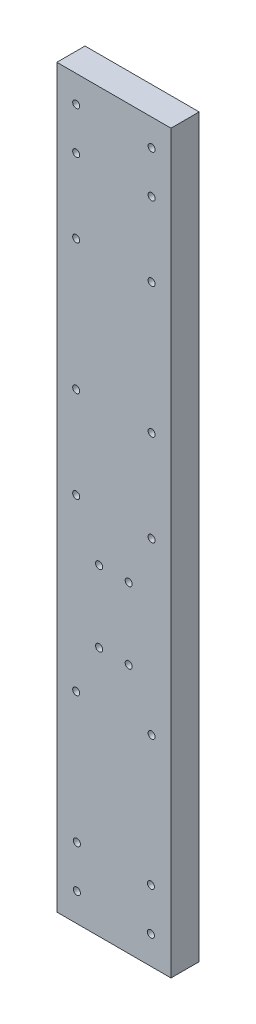
ISO-10303-21;
HEADER;
FILE_DESCRIPTION(('STEP AP214'),'2;1');
FILE_NAME('part.step','',(''),(''),'','','');
FILE_SCHEMA(('AUTOMOTIVE_DESIGN { 1 0 10303 214 1 1 1 1 }'));
ENDSEC;
DATA;
#1=APPLICATION_CONTEXT('core data for automotive mechanical design processes');
#2=APPLICATION_PROTOCOL_DEFINITION('international standard','automotive_design',2000,#1);
#3=PRODUCT_CONTEXT('',#1,'mechanical');
#4=PRODUCT('Part','Part','',(#3));
#5=PRODUCT_RELATED_PRODUCT_CATEGORY('part','',(#4));
#6=PRODUCT_DEFINITION_FORMATION('','',#4);
#7=PRODUCT_DEFINITION_CONTEXT('part definition',#1,'design');
#8=PRODUCT_DEFINITION('design','',#6,#7);
#9=PRODUCT_DEFINITION_SHAPE('','',#8);
#10=(LENGTH_UNIT() NAMED_UNIT(*) SI_UNIT(.MILLI.,.METRE.));
#11=(NAMED_UNIT(*) PLANE_ANGLE_UNIT() SI_UNIT($,.RADIAN.));
#12=(NAMED_UNIT(*) SI_UNIT($,.STERADIAN.) SOLID_ANGLE_UNIT());
#13=UNCERTAINTY_MEASURE_WITH_UNIT(LENGTH_MEASURE(1.E-05),#10,'distance_accuracy_value','');
#14=(GEOMETRIC_REPRESENTATION_CONTEXT(3) GLOBAL_UNCERTAINTY_ASSIGNED_CONTEXT((#13)) GLOBAL_UNIT_ASSIGNED_CONTEXT((#10,
#11,#12)) REPRESENTATION_CONTEXT('',''));
#15=CARTESIAN_POINT('',(0.,0.,0.));
#16=DIRECTION('',(0.,0.,1.));
#17=DIRECTION('',(1.,0.,0.));
#18=AXIS2_PLACEMENT_3D('',#15,#16,#17);
#19=CARTESIAN_POINT('',(0.,0.,4.));
#20=DIRECTION('',(0.,0.,-1.));
#21=DIRECTION('',(-1.,0.,0.));
#22=AXIS2_PLACEMENT_3D('',#19,#20,#21);
#23=PLANE('',#22);
#24=CARTESIAN_POINT('',(13.4499999999989,100.665,4.));
#25=DIRECTION('',(0.,0.,1.));
#26=DIRECTION('',(-1.,0.,0.));
#27=AXIS2_PLACEMENT_3D('',#24,#25,#26);
#28=CIRCLE('',#27,0.499999999999994);
#29=CARTESIAN_POINT('',(12.9499999999989,100.665,4.));
#30=VERTEX_POINT('',#29);
#31=EDGE_CURVE('E217',#30,#30,#28,.T.);
#32=ORIENTED_EDGE('',*,*,#31,.F.);
#33=EDGE_LOOP('',(#32));
#34=FACE_BOUND('',#33,.T.);
#35=CARTESIAN_POINT('',(13.350000000001,10.,4.));
#36=DIRECTION('',(0.,0.,1.));
#37=DIRECTION('',(-1.,0.,0.));
#38=AXIS2_PLACEMENT_3D('',#35,#36,#37);
#39=CIRCLE('',#38,0.499999999999995);
#40=CARTESIAN_POINT('',(12.850000000001,10.,4.));
#41=VERTEX_POINT('',#40);
#42=EDGE_CURVE('E205',#41,#41,#39,.T.);
#43=ORIENTED_EDGE('',*,*,#42,.F.);
#44=EDGE_LOOP('',(#43));
#45=FACE_BOUND('',#44,.T.);
#46=CARTESIAN_POINT('',(2.85,10.,4.));
#47=DIRECTION('',(0.,0.,1.));
#48=DIRECTION('',(1.,0.,0.));
#49=AXIS2_PLACEMENT_3D('',#46,#47,#48);
#50=CIRCLE('',#49,0.499999999999999);
#51=CARTESIAN_POINT('',(3.35,10.,4.));
#52=VERTEX_POINT('',#51);
#53=EDGE_CURVE('E193',#52,#52,#50,.T.);
#54=ORIENTED_EDGE('',*,*,#53,.F.);
#55=EDGE_LOOP('',(#54));
#56=FACE_BOUND('',#55,.T.);
#57=CARTESIAN_POINT('',(13.4499999999999,94.665,4.));
#58=DIRECTION('',(0.,0.,1.));
#59=DIRECTION('',(1.,0.,0.));
#60=AXIS2_PLACEMENT_3D('',#57,#58,#59);
#61=CIRCLE('',#60,0.499999999999994);
#62=CARTESIAN_POINT('',(13.9499999999999,94.665,4.));
#63=VERTEX_POINT('',#62);
#64=EDGE_CURVE('E181',#63,#63,#61,.T.);
#65=ORIENTED_EDGE('',*,*,#64,.F.);
#66=EDGE_LOOP('',(#65));
#67=FACE_BOUND('',#66,.T.);
#68=CARTESIAN_POINT('',(13.4499999999987,84.165,4.));
#69=DIRECTION('',(0.,0.,1.));
#70=DIRECTION('',(1.,0.,0.));
#71=AXIS2_PLACEMENT_3D('',#68,#69,#70);
#72=CIRCLE('',#71,0.499999999999994);
#73=CARTESIAN_POINT('',(13.9499999999987,84.165,4.));
#74=VERTEX_POINT('',#73);
#75=EDGE_CURVE('E169',#74,#74,#72,.T.);
#76=ORIENTED_EDGE('',*,*,#75,.F.);
#77=EDGE_LOOP('',(#76));
#78=FACE_BOUND('',#77,.T.);
#79=CARTESIAN_POINT('',(13.45,28.5,4.));
#80=DIRECTION('',(0.,0.,1.));
#81=DIRECTION('',(1.,0.,0.));
#82=AXIS2_PLACEMENT_3D('',#79,#80,#81);
#83=CIRCLE('',#82,0.499999999999993);
#84=CARTESIAN_POINT('',(13.95,28.5,4.));
#85=VERTEX_POINT('',#84);
#86=EDGE_CURVE('E157',#85,#85,#83,.T.);
#87=ORIENTED_EDGE('',*,*,#86,.F.);
#88=EDGE_LOOP('',(#87));
#89=FACE_BOUND('',#88,.T.);
#90=CARTESIAN_POINT('',(10.2,35.5,4.));
#91=DIRECTION('',(0.,0.,1.));
#92=DIRECTION('',(1.,0.,0.));
#93=AXIS2_PLACEMENT_3D('',#90,#91,#92);
#94=CIRCLE('',#93,0.499999999999999);
#95=CARTESIAN_POINT('',(10.7,35.5,4.));
#96=VERTEX_POINT('',#95);
#97=EDGE_CURVE('E145',#96,#96,#94,.T.);
#98=ORIENTED_EDGE('',*,*,#97,.F.);
#99=EDGE_LOOP('',(#98));
#100=FACE_BOUND('',#99,.T.);
#101=CARTESIAN_POINT('',(13.4500000000003,65.64,4.));
#102=DIRECTION('',(0.,0.,1.));
#103=DIRECTION('',(1.,0.,0.));
#104=AXIS2_PLACEMENT_3D('',#101,#102,#103);
#105=CIRCLE('',#104,0.499999999999994);
#106=CARTESIAN_POINT('',(13.9500000000003,65.64,4.));
#107=VERTEX_POINT('',#106);
#108=EDGE_CURVE('E133',#107,#107,#105,.T.);
#109=ORIENTED_EDGE('',*,*,#108,.F.);
#110=EDGE_LOOP('',(#109));
#111=FACE_BOUND('',#110,.T.);
#112=CARTESIAN_POINT('',(13.45,52.64,4.));
#113=DIRECTION('',(0.,0.,1.));
#114=DIRECTION('',(1.,0.,0.));
#115=AXIS2_PLACEMENT_3D('',#112,#113,#114);
#116=CIRCLE('',#115,0.499999999999999);
#117=CARTESIAN_POINT('',(13.95,52.64,4.));
#118=VERTEX_POINT('',#117);
#119=EDGE_CURVE('E121',#118,#118,#116,.T.);
#120=ORIENTED_EDGE('',*,*,#119,.F.);
#121=EDGE_LOOP('',(#120));
#122=FACE_BOUND('',#121,.T.);
#123=CARTESIAN_POINT('',(10.2,45.64,4.));
#124=DIRECTION('',(0.,0.,1.));
#125=DIRECTION('',(1.,0.,0.));
#126=AXIS2_PLACEMENT_3D('',#123,#124,#125);
#127=CIRCLE('',#126,0.499999999999999);
#128=CARTESIAN_POINT('',(10.7,45.64,4.));
#129=VERTEX_POINT('',#128);
#130=EDGE_CURVE('E100',#129,#129,#127,.T.);
#131=ORIENTED_EDGE('',*,*,#130,.F.);
#132=EDGE_LOOP('',(#131));
#133=FACE_BOUND('',#132,.T.);
#134=DIRECTION('',(1.,0.,0.));
#135=VECTOR('',#134,1.);
#136=CARTESIAN_POINT('',(0.,0.,4.));
#137=LINE('',#136,#135);
#138=CARTESIAN_POINT('',(0.,0.,4.));
#139=VERTEX_POINT('',#138);
#140=CARTESIAN_POINT('',(16.2,0.,4.));
#141=VERTEX_POINT('',#140);
#142=EDGE_CURVE('E85',#139,#141,#137,.T.);
#143=ORIENTED_EDGE('',*,*,#142,.T.);
#144=DIRECTION('',(0.,1.,0.));
#145=VECTOR('',#144,1.);
#146=CARTESIAN_POINT('',(16.2,104.46,4.));
#147=LINE('',#146,#145);
#148=CARTESIAN_POINT('',(16.2,104.46,4.));
#149=VERTEX_POINT('',#148);
#150=EDGE_CURVE('E80',#141,#149,#147,.T.);
#151=ORIENTED_EDGE('',*,*,#150,.T.);
#152=DIRECTION('',(-1.,0.,0.));
#153=VECTOR('',#152,1.);
#154=CARTESIAN_POINT('',(0.,104.46,4.));
#155=LINE('',#154,#153);
#156=CARTESIAN_POINT('',(0.,104.46,4.));
#157=VERTEX_POINT('',#156);
#158=EDGE_CURVE('E83',#149,#157,#155,.T.);
#159=ORIENTED_EDGE('',*,*,#158,.T.);
#160=DIRECTION('',(0.,-1.,0.));
#161=VECTOR('',#160,1.);
#162=CARTESIAN_POINT('',(0.,104.46,4.));
#163=LINE('',#162,#161);
#164=EDGE_CURVE('E50',#157,#139,#163,.T.);
#165=ORIENTED_EDGE('',*,*,#164,.T.);
#166=EDGE_LOOP('',(#143,#151,#159,#165));
#167=FACE_BOUND('',#166,.T.);
#168=CARTESIAN_POINT('',(5.99999999999999,45.64,4.));
#169=DIRECTION('',(0.,0.,1.));
#170=DIRECTION('',(1.,0.,0.));
#171=AXIS2_PLACEMENT_3D('',#168,#169,#170);
#172=CIRCLE('',#171,0.500000000000002);
#173=CARTESIAN_POINT('',(6.5,45.64,4.));
#174=VERTEX_POINT('',#173);
#175=EDGE_CURVE('E115',#174,#174,#172,.T.);
#176=ORIENTED_EDGE('',*,*,#175,.F.);
#177=EDGE_LOOP('',(#176));
#178=FACE_BOUND('',#177,.T.);
#179=CARTESIAN_POINT('',(2.74999999999999,52.64,4.));
#180=DIRECTION('',(0.,0.,1.));
#181=DIRECTION('',(1.,0.,0.));
#182=AXIS2_PLACEMENT_3D('',#179,#180,#181);
#183=CIRCLE('',#182,0.499999999999999);
#184=CARTESIAN_POINT('',(3.24999999999999,52.64,4.));
#185=VERTEX_POINT('',#184);
#186=EDGE_CURVE('E127',#185,#185,#183,.T.);
#187=ORIENTED_EDGE('',*,*,#186,.F.);
#188=EDGE_LOOP('',(#187));
#189=FACE_BOUND('',#188,.T.);
#190=CARTESIAN_POINT('',(2.74999999999999,65.64,4.));
#191=DIRECTION('',(0.,0.,1.));
#192=DIRECTION('',(1.,0.,0.));
#193=AXIS2_PLACEMENT_3D('',#190,#191,#192);
#194=CIRCLE('',#193,0.499999999999999);
#195=CARTESIAN_POINT('',(3.24999999999999,65.64,4.));
#196=VERTEX_POINT('',#195);
#197=EDGE_CURVE('E139',#196,#196,#194,.T.);
#198=ORIENTED_EDGE('',*,*,#197,.F.);
#199=EDGE_LOOP('',(#198));
#200=FACE_BOUND('',#199,.T.);
#201=CARTESIAN_POINT('',(6.,35.5,4.));
#202=DIRECTION('',(0.,0.,1.));
#203=DIRECTION('',(1.,0.,0.));
#204=AXIS2_PLACEMENT_3D('',#201,#202,#203);
#205=CIRCLE('',#204,0.5);
#206=CARTESIAN_POINT('',(6.5,35.5,4.));
#207=VERTEX_POINT('',#206);
#208=EDGE_CURVE('E151',#207,#207,#205,.T.);
#209=ORIENTED_EDGE('',*,*,#208,.F.);
#210=EDGE_LOOP('',(#209));
#211=FACE_BOUND('',#210,.T.);
#212=CARTESIAN_POINT('',(2.75,28.5,4.));
#213=DIRECTION('',(0.,0.,1.));
#214=DIRECTION('',(1.,0.,0.));
#215=AXIS2_PLACEMENT_3D('',#212,#213,#214);
#216=CIRCLE('',#215,0.499999999999999);
#217=CARTESIAN_POINT('',(3.25,28.5,4.));
#218=VERTEX_POINT('',#217);
#219=EDGE_CURVE('E163',#218,#218,#216,.T.);
#220=ORIENTED_EDGE('',*,*,#219,.F.);
#221=EDGE_LOOP('',(#220));
#222=FACE_BOUND('',#221,.T.);
#223=CARTESIAN_POINT('',(2.74999999999866,84.165,4.));
#224=DIRECTION('',(0.,0.,1.));
#225=DIRECTION('',(1.,0.,0.));
#226=AXIS2_PLACEMENT_3D('',#223,#224,#225);
#227=CIRCLE('',#226,0.499999999999999);
#228=CARTESIAN_POINT('',(3.24999999999866,84.165,4.));
#229=VERTEX_POINT('',#228);
#230=EDGE_CURVE('E175',#229,#229,#227,.T.);
#231=ORIENTED_EDGE('',*,*,#230,.F.);
#232=EDGE_LOOP('',(#231));
#233=FACE_BOUND('',#232,.T.);
#234=CARTESIAN_POINT('',(2.74999999999866,94.665,4.));
#235=DIRECTION('',(0.,0.,1.));
#236=DIRECTION('',(1.,0.,0.));
#237=AXIS2_PLACEMENT_3D('',#234,#235,#236);
#238=CIRCLE('',#237,0.499999999999999);
#239=CARTESIAN_POINT('',(3.24999999999866,94.665,4.));
#240=VERTEX_POINT('',#239);
#241=EDGE_CURVE('E187',#240,#240,#238,.T.);
#242=ORIENTED_EDGE('',*,*,#241,.F.);
#243=EDGE_LOOP('',(#242));
#244=FACE_BOUND('',#243,.T.);
#245=CARTESIAN_POINT('',(2.85,4.,4.));
#246=DIRECTION('',(0.,0.,1.));
#247=DIRECTION('',(1.,0.,0.));
#248=AXIS2_PLACEMENT_3D('',#245,#246,#247);
#249=CIRCLE('',#248,0.499999999999999);
#250=CARTESIAN_POINT('',(3.35,4.,4.));
#251=VERTEX_POINT('',#250);
#252=EDGE_CURVE('E199',#251,#251,#249,.T.);
#253=ORIENTED_EDGE('',*,*,#252,.F.);
#254=EDGE_LOOP('',(#253));
#255=FACE_BOUND('',#254,.T.);
#256=CARTESIAN_POINT('',(13.350000000001,4.,4.));
#257=DIRECTION('',(0.,0.,1.));
#258=DIRECTION('',(-1.,0.,0.));
#259=AXIS2_PLACEMENT_3D('',#256,#257,#258);
#260=CIRCLE('',#259,0.499999999999999);
#261=CARTESIAN_POINT('',(12.850000000001,4.,4.));
#262=VERTEX_POINT('',#261);
#263=EDGE_CURVE('E211',#262,#262,#260,.T.);
#264=ORIENTED_EDGE('',*,*,#263,.F.);
#265=EDGE_LOOP('',(#264));
#266=FACE_BOUND('',#265,.T.);
#267=CARTESIAN_POINT('',(2.74999999999866,100.665,4.));
#268=DIRECTION('',(0.,0.,1.));
#269=DIRECTION('',(-1.,0.,0.));
#270=AXIS2_PLACEMENT_3D('',#267,#268,#269);
#271=CIRCLE('',#270,0.499999999999999);
#272=CARTESIAN_POINT('',(2.24999999999866,100.665,4.));
#273=VERTEX_POINT('',#272);
#274=EDGE_CURVE('E223',#273,#273,#271,.T.);
#275=ORIENTED_EDGE('',*,*,#274,.F.);
#276=EDGE_LOOP('',(#275));
#277=FACE_BOUND('',#276,.T.);
#278=ADVANCED_FACE('F33',(#34,#45,#56,#67,#78,#89,#100,#111,#122,#133,#167,#178,#189,#200,#211,
#222,#233,#244,#255,#266,#277),#23,.F.);
#279=CARTESIAN_POINT('',(0.,0.,0.));
#280=DIRECTION('',(0.,0.,-1.));
#281=DIRECTION('',(-1.,0.,0.));
#282=AXIS2_PLACEMENT_3D('',#279,#280,#281);
#283=PLANE('',#282);
#284=CARTESIAN_POINT('',(13.4499999999989,100.665,0.));
#285=DIRECTION('',(0.,0.,1.));
#286=DIRECTION('',(-1.,0.,0.));
#287=AXIS2_PLACEMENT_3D('',#284,#285,#286);
#288=CIRCLE('',#287,0.499999999999994);
#289=CARTESIAN_POINT('',(12.9499999999989,100.665,0.));
#290=VERTEX_POINT('',#289);
#291=EDGE_CURVE('E220',#290,#290,#288,.T.);
#292=ORIENTED_EDGE('',*,*,#291,.T.);
#293=EDGE_LOOP('',(#292));
#294=FACE_BOUND('',#293,.T.);
#295=CARTESIAN_POINT('',(13.350000000001,10.,0.));
#296=DIRECTION('',(0.,0.,1.));
#297=DIRECTION('',(-1.,0.,0.));
#298=AXIS2_PLACEMENT_3D('',#295,#296,#297);
#299=CIRCLE('',#298,0.499999999999995);
#300=CARTESIAN_POINT('',(12.850000000001,10.,0.));
#301=VERTEX_POINT('',#300);
#302=EDGE_CURVE('E208',#301,#301,#299,.T.);
#303=ORIENTED_EDGE('',*,*,#302,.T.);
#304=EDGE_LOOP('',(#303));
#305=FACE_BOUND('',#304,.T.);
#306=CARTESIAN_POINT('',(2.85,10.,0.));
#307=DIRECTION('',(0.,0.,1.));
#308=DIRECTION('',(1.,0.,0.));
#309=AXIS2_PLACEMENT_3D('',#306,#307,#308);
#310=CIRCLE('',#309,0.499999999999999);
#311=CARTESIAN_POINT('',(3.35,10.,0.));
#312=VERTEX_POINT('',#311);
#313=EDGE_CURVE('E196',#312,#312,#310,.T.);
#314=ORIENTED_EDGE('',*,*,#313,.T.);
#315=EDGE_LOOP('',(#314));
#316=FACE_BOUND('',#315,.T.);
#317=CARTESIAN_POINT('',(13.4499999999999,94.665,0.));
#318=DIRECTION('',(0.,0.,1.));
#319=DIRECTION('',(1.,0.,0.));
#320=AXIS2_PLACEMENT_3D('',#317,#318,#319);
#321=CIRCLE('',#320,0.499999999999994);
#322=CARTESIAN_POINT('',(13.9499999999999,94.665,0.));
#323=VERTEX_POINT('',#322);
#324=EDGE_CURVE('E184',#323,#323,#321,.T.);
#325=ORIENTED_EDGE('',*,*,#324,.T.);
#326=EDGE_LOOP('',(#325));
#327=FACE_BOUND('',#326,.T.);
#328=CARTESIAN_POINT('',(13.4499999999987,84.165,0.));
#329=DIRECTION('',(0.,0.,1.));
#330=DIRECTION('',(1.,0.,0.));
#331=AXIS2_PLACEMENT_3D('',#328,#329,#330);
#332=CIRCLE('',#331,0.499999999999994);
#333=CARTESIAN_POINT('',(13.9499999999987,84.165,0.));
#334=VERTEX_POINT('',#333);
#335=EDGE_CURVE('E172',#334,#334,#332,.T.);
#336=ORIENTED_EDGE('',*,*,#335,.T.);
#337=EDGE_LOOP('',(#336));
#338=FACE_BOUND('',#337,.T.);
#339=CARTESIAN_POINT('',(13.45,28.5,0.));
#340=DIRECTION('',(0.,0.,1.));
#341=DIRECTION('',(1.,0.,0.));
#342=AXIS2_PLACEMENT_3D('',#339,#340,#341);
#343=CIRCLE('',#342,0.499999999999993);
#344=CARTESIAN_POINT('',(13.95,28.5,0.));
#345=VERTEX_POINT('',#344);
#346=EDGE_CURVE('E160',#345,#345,#343,.T.);
#347=ORIENTED_EDGE('',*,*,#346,.T.);
#348=EDGE_LOOP('',(#347));
#349=FACE_BOUND('',#348,.T.);
#350=CARTESIAN_POINT('',(10.2,35.5,0.));
#351=DIRECTION('',(0.,0.,1.));
#352=DIRECTION('',(1.,0.,0.));
#353=AXIS2_PLACEMENT_3D('',#350,#351,#352);
#354=CIRCLE('',#353,0.499999999999999);
#355=CARTESIAN_POINT('',(10.7,35.5,0.));
#356=VERTEX_POINT('',#355);
#357=EDGE_CURVE('E148',#356,#356,#354,.T.);
#358=ORIENTED_EDGE('',*,*,#357,.T.);
#359=EDGE_LOOP('',(#358));
#360=FACE_BOUND('',#359,.T.);
#361=CARTESIAN_POINT('',(13.4500000000003,65.64,0.));
#362=DIRECTION('',(0.,0.,1.));
#363=DIRECTION('',(1.,0.,0.));
#364=AXIS2_PLACEMENT_3D('',#361,#362,#363);
#365=CIRCLE('',#364,0.499999999999994);
#366=CARTESIAN_POINT('',(13.9500000000003,65.64,0.));
#367=VERTEX_POINT('',#366);
#368=EDGE_CURVE('E136',#367,#367,#365,.T.);
#369=ORIENTED_EDGE('',*,*,#368,.T.);
#370=EDGE_LOOP('',(#369));
#371=FACE_BOUND('',#370,.T.);
#372=CARTESIAN_POINT('',(13.45,52.64,0.));
#373=DIRECTION('',(0.,0.,1.));
#374=DIRECTION('',(1.,0.,0.));
#375=AXIS2_PLACEMENT_3D('',#372,#373,#374);
#376=CIRCLE('',#375,0.499999999999999);
#377=CARTESIAN_POINT('',(13.95,52.64,0.));
#378=VERTEX_POINT('',#377);
#379=EDGE_CURVE('E124',#378,#378,#376,.T.);
#380=ORIENTED_EDGE('',*,*,#379,.T.);
#381=EDGE_LOOP('',(#380));
#382=FACE_BOUND('',#381,.T.);
#383=CARTESIAN_POINT('',(10.2,45.64,0.));
#384=DIRECTION('',(0.,0.,1.));
#385=DIRECTION('',(1.,0.,0.));
#386=AXIS2_PLACEMENT_3D('',#383,#384,#385);
#387=CIRCLE('',#386,0.499999999999999);
#388=CARTESIAN_POINT('',(10.7,45.64,0.));
#389=VERTEX_POINT('',#388);
#390=EDGE_CURVE('E112',#389,#389,#387,.T.);
#391=ORIENTED_EDGE('',*,*,#390,.T.);
#392=EDGE_LOOP('',(#391));
#393=FACE_BOUND('',#392,.T.);
#394=DIRECTION('',(1.,0.,0.));
#395=VECTOR('',#394,1.);
#396=CARTESIAN_POINT('',(0.,0.,0.));
#397=LINE('',#396,#395);
#398=CARTESIAN_POINT('',(0.,0.,0.));
#399=VERTEX_POINT('',#398);
#400=CARTESIAN_POINT('',(16.2,0.,0.));
#401=VERTEX_POINT('',#400);
#402=EDGE_CURVE('E97',#399,#401,#397,.T.);
#403=ORIENTED_EDGE('',*,*,#402,.F.);
#404=DIRECTION('',(0.,-1.,0.));
#405=VECTOR('',#404,1.);
#406=CARTESIAN_POINT('',(0.,104.46,0.));
#407=LINE('',#406,#405);
#408=CARTESIAN_POINT('',(0.,104.46,0.));
#409=VERTEX_POINT('',#408);
#410=EDGE_CURVE('E73',#409,#399,#407,.T.);
#411=ORIENTED_EDGE('',*,*,#410,.F.);
#412=DIRECTION('',(-1.,0.,0.));
#413=VECTOR('',#412,1.);
#414=CARTESIAN_POINT('',(0.,104.46,0.));
#415=LINE('',#414,#413);
#416=CARTESIAN_POINT('',(16.2,104.46,0.));
#417=VERTEX_POINT('',#416);
#418=EDGE_CURVE('E67',#417,#409,#415,.T.);
#419=ORIENTED_EDGE('',*,*,#418,.F.);
#420=DIRECTION('',(0.,1.,0.));
#421=VECTOR('',#420,1.);
#422=CARTESIAN_POINT('',(16.2,104.46,0.));
#423=LINE('',#422,#421);
#424=EDGE_CURVE('E89',#401,#417,#423,.T.);
#425=ORIENTED_EDGE('',*,*,#424,.F.);
#426=EDGE_LOOP('',(#403,#411,#419,#425));
#427=FACE_BOUND('',#426,.T.);
#428=CARTESIAN_POINT('',(5.99999999999999,45.64,0.));
#429=DIRECTION('',(0.,0.,1.));
#430=DIRECTION('',(1.,0.,0.));
#431=AXIS2_PLACEMENT_3D('',#428,#429,#430);
#432=CIRCLE('',#431,0.500000000000002);
#433=CARTESIAN_POINT('',(6.5,45.64,0.));
#434=VERTEX_POINT('',#433);
#435=EDGE_CURVE('E118',#434,#434,#432,.T.);
#436=ORIENTED_EDGE('',*,*,#435,.T.);
#437=EDGE_LOOP('',(#436));
#438=FACE_BOUND('',#437,.T.);
#439=CARTESIAN_POINT('',(2.74999999999999,52.64,0.));
#440=DIRECTION('',(0.,0.,1.));
#441=DIRECTION('',(1.,0.,0.));
#442=AXIS2_PLACEMENT_3D('',#439,#440,#441);
#443=CIRCLE('',#442,0.499999999999999);
#444=CARTESIAN_POINT('',(3.24999999999999,52.64,0.));
#445=VERTEX_POINT('',#444);
#446=EDGE_CURVE('E130',#445,#445,#443,.T.);
#447=ORIENTED_EDGE('',*,*,#446,.T.);
#448=EDGE_LOOP('',(#447));
#449=FACE_BOUND('',#448,.T.);
#450=CARTESIAN_POINT('',(2.74999999999999,65.64,0.));
#451=DIRECTION('',(0.,0.,1.));
#452=DIRECTION('',(1.,0.,0.));
#453=AXIS2_PLACEMENT_3D('',#450,#451,#452);
#454=CIRCLE('',#453,0.499999999999999);
#455=CARTESIAN_POINT('',(3.24999999999999,65.64,0.));
#456=VERTEX_POINT('',#455);
#457=EDGE_CURVE('E142',#456,#456,#454,.T.);
#458=ORIENTED_EDGE('',*,*,#457,.T.);
#459=EDGE_LOOP('',(#458));
#460=FACE_BOUND('',#459,.T.);
#461=CARTESIAN_POINT('',(6.,35.5,0.));
#462=DIRECTION('',(0.,0.,1.));
#463=DIRECTION('',(1.,0.,0.));
#464=AXIS2_PLACEMENT_3D('',#461,#462,#463);
#465=CIRCLE('',#464,0.5);
#466=CARTESIAN_POINT('',(6.5,35.5,0.));
#467=VERTEX_POINT('',#466);
#468=EDGE_CURVE('E154',#467,#467,#465,.T.);
#469=ORIENTED_EDGE('',*,*,#468,.T.);
#470=EDGE_LOOP('',(#469));
#471=FACE_BOUND('',#470,.T.);
#472=CARTESIAN_POINT('',(2.75,28.5,0.));
#473=DIRECTION('',(0.,0.,1.));
#474=DIRECTION('',(1.,0.,0.));
#475=AXIS2_PLACEMENT_3D('',#472,#473,#474);
#476=CIRCLE('',#475,0.499999999999999);
#477=CARTESIAN_POINT('',(3.25,28.5,0.));
#478=VERTEX_POINT('',#477);
#479=EDGE_CURVE('E166',#478,#478,#476,.T.);
#480=ORIENTED_EDGE('',*,*,#479,.T.);
#481=EDGE_LOOP('',(#480));
#482=FACE_BOUND('',#481,.T.);
#483=CARTESIAN_POINT('',(2.74999999999866,84.165,0.));
#484=DIRECTION('',(0.,0.,1.));
#485=DIRECTION('',(1.,0.,0.));
#486=AXIS2_PLACEMENT_3D('',#483,#484,#485);
#487=CIRCLE('',#486,0.499999999999999);
#488=CARTESIAN_POINT('',(3.24999999999866,84.165,0.));
#489=VERTEX_POINT('',#488);
#490=EDGE_CURVE('E178',#489,#489,#487,.T.);
#491=ORIENTED_EDGE('',*,*,#490,.T.);
#492=EDGE_LOOP('',(#491));
#493=FACE_BOUND('',#492,.T.);
#494=CARTESIAN_POINT('',(2.74999999999866,94.665,0.));
#495=DIRECTION('',(0.,0.,1.));
#496=DIRECTION('',(1.,0.,0.));
#497=AXIS2_PLACEMENT_3D('',#494,#495,#496);
#498=CIRCLE('',#497,0.499999999999999);
#499=CARTESIAN_POINT('',(3.24999999999866,94.665,0.));
#500=VERTEX_POINT('',#499);
#501=EDGE_CURVE('E190',#500,#500,#498,.T.);
#502=ORIENTED_EDGE('',*,*,#501,.T.);
#503=EDGE_LOOP('',(#502));
#504=FACE_BOUND('',#503,.T.);
#505=CARTESIAN_POINT('',(2.85,4.,0.));
#506=DIRECTION('',(0.,0.,1.));
#507=DIRECTION('',(1.,0.,0.));
#508=AXIS2_PLACEMENT_3D('',#505,#506,#507);
#509=CIRCLE('',#508,0.499999999999999);
#510=CARTESIAN_POINT('',(3.35,4.,0.));
#511=VERTEX_POINT('',#510);
#512=EDGE_CURVE('E202',#511,#511,#509,.T.);
#513=ORIENTED_EDGE('',*,*,#512,.T.);
#514=EDGE_LOOP('',(#513));
#515=FACE_BOUND('',#514,.T.);
#516=CARTESIAN_POINT('',(13.350000000001,4.,0.));
#517=DIRECTION('',(0.,0.,1.));
#518=DIRECTION('',(-1.,0.,0.));
#519=AXIS2_PLACEMENT_3D('',#516,#517,#518);
#520=CIRCLE('',#519,0.499999999999999);
#521=CARTESIAN_POINT('',(12.850000000001,4.,0.));
#522=VERTEX_POINT('',#521);
#523=EDGE_CURVE('E214',#522,#522,#520,.T.);
#524=ORIENTED_EDGE('',*,*,#523,.T.);
#525=EDGE_LOOP('',(#524));
#526=FACE_BOUND('',#525,.T.);
#527=CARTESIAN_POINT('',(2.74999999999866,100.665,0.));
#528=DIRECTION('',(0.,0.,1.));
#529=DIRECTION('',(-1.,0.,0.));
#530=AXIS2_PLACEMENT_3D('',#527,#528,#529);
#531=CIRCLE('',#530,0.499999999999999);
#532=CARTESIAN_POINT('',(2.24999999999866,100.665,0.));
#533=VERTEX_POINT('',#532);
#534=EDGE_CURVE('E226',#533,#533,#531,.T.);
#535=ORIENTED_EDGE('',*,*,#534,.T.);
#536=EDGE_LOOP('',(#535));
#537=FACE_BOUND('',#536,.T.);
#538=ADVANCED_FACE('F108',(#294,#305,#316,#327,#338,#349,#360,#371,#382,#393,#427,#438,#449,
#460,#471,#482,#493,#504,#515,#526,#537),#283,.T.);
#539=CARTESIAN_POINT('',(0.,0.,4.));
#540=DIRECTION('',(0.,1.,0.));
#541=DIRECTION('',(-1.,0.,0.));
#542=AXIS2_PLACEMENT_3D('',#539,#540,#541);
#543=PLANE('',#542);
#544=ORIENTED_EDGE('',*,*,#402,.T.);
#545=DIRECTION('',(0.,0.,-1.));
#546=VECTOR('',#545,1.);
#547=CARTESIAN_POINT('',(16.2,0.,4.));
#548=LINE('',#547,#546);
#549=EDGE_CURVE('E11',#141,#401,#548,.T.);
#550=ORIENTED_EDGE('',*,*,#549,.F.);
#551=ORIENTED_EDGE('',*,*,#142,.F.);
#552=DIRECTION('',(0.,0.,-1.));
#553=VECTOR('',#552,1.);
#554=CARTESIAN_POINT('',(0.,0.,4.));
#555=LINE('',#554,#553);
#556=EDGE_CURVE('E93',#139,#399,#555,.T.);
#557=ORIENTED_EDGE('',*,*,#556,.T.);
#558=EDGE_LOOP('',(#544,#550,#551,#557));
#559=FACE_BOUND('',#558,.T.);
#560=ADVANCED_FACE('F35',(#559),#543,.F.);
#561=CARTESIAN_POINT('',(16.2,104.46,4.));
#562=DIRECTION('',(-1.,0.,0.));
#563=DIRECTION('',(0.,-1.,0.));
#564=AXIS2_PLACEMENT_3D('',#561,#562,#563);
#565=PLANE('',#564);
#566=ORIENTED_EDGE('',*,*,#424,.T.);
#567=DIRECTION('',(0.,0.,-1.));
#568=VECTOR('',#567,1.);
#569=CARTESIAN_POINT('',(16.2,104.46,4.));
#570=LINE('',#569,#568);
#571=EDGE_CURVE('E42',#149,#417,#570,.T.);
#572=ORIENTED_EDGE('',*,*,#571,.F.);
#573=ORIENTED_EDGE('',*,*,#150,.F.);
#574=ORIENTED_EDGE('',*,*,#549,.T.);
#575=EDGE_LOOP('',(#566,#572,#573,#574));
#576=FACE_BOUND('',#575,.T.);
#577=ADVANCED_FACE('F88',(#576),#565,.F.);
#578=CARTESIAN_POINT('',(0.,104.46,4.));
#579=DIRECTION('',(0.,-1.,0.));
#580=DIRECTION('',(0.,0.,-1.));
#581=AXIS2_PLACEMENT_3D('',#578,#579,#580);
#582=PLANE('',#581);
#583=ORIENTED_EDGE('',*,*,#418,.T.);
#584=DIRECTION('',(0.,0.,-1.));
#585=VECTOR('',#584,1.);
#586=CARTESIAN_POINT('',(0.,104.46,4.));
#587=LINE('',#586,#585);
#588=EDGE_CURVE('E90',#157,#409,#587,.T.);
#589=ORIENTED_EDGE('',*,*,#588,.F.);
#590=ORIENTED_EDGE('',*,*,#158,.F.);
#591=ORIENTED_EDGE('',*,*,#571,.T.);
#592=EDGE_LOOP('',(#583,#589,#590,#591));
#593=FACE_BOUND('',#592,.T.);
#594=ADVANCED_FACE('F91',(#593),#582,.F.);
#595=CARTESIAN_POINT('',(0.,104.46,4.));
#596=DIRECTION('',(1.,0.,0.));
#597=DIRECTION('',(0.,1.,0.));
#598=AXIS2_PLACEMENT_3D('',#595,#596,#597);
#599=PLANE('',#598);
#600=ORIENTED_EDGE('',*,*,#410,.T.);
#601=ORIENTED_EDGE('',*,*,#556,.F.);
#602=ORIENTED_EDGE('',*,*,#164,.F.);
#603=ORIENTED_EDGE('',*,*,#588,.T.);
#604=EDGE_LOOP('',(#600,#601,#602,#603));
#605=FACE_BOUND('',#604,.T.);
#606=ADVANCED_FACE('F105',(#605),#599,.F.);
#607=CARTESIAN_POINT('',(10.2,45.64,4.));
#608=DIRECTION('',(0.,0.,-1.));
#609=DIRECTION('',(-1.,0.,0.));
#610=AXIS2_PLACEMENT_3D('',#607,#608,#609);
#611=CYLINDRICAL_SURFACE('',#610,0.499999999999999);
#612=ORIENTED_EDGE('',*,*,#130,.T.);
#613=EDGE_LOOP('',(#612));
#614=FACE_BOUND('',#613,.T.);
#615=ORIENTED_EDGE('',*,*,#390,.F.);
#616=EDGE_LOOP('',(#615));
#617=FACE_BOUND('',#616,.T.);
#618=ADVANCED_FACE('F246',(#614,#617),#611,.F.);
#619=CARTESIAN_POINT('',(5.99999999999999,45.64,4.));
#620=DIRECTION('',(0.,0.,-1.));
#621=DIRECTION('',(-1.,0.,0.));
#622=AXIS2_PLACEMENT_3D('',#619,#620,#621);
#623=CYLINDRICAL_SURFACE('',#622,0.500000000000002);
#624=ORIENTED_EDGE('',*,*,#175,.T.);
#625=EDGE_LOOP('',(#624));
#626=FACE_BOUND('',#625,.T.);
#627=ORIENTED_EDGE('',*,*,#435,.F.);
#628=EDGE_LOOP('',(#627));
#629=FACE_BOUND('',#628,.T.);
#630=ADVANCED_FACE('F292',(#626,#629),#623,.F.);
#631=CARTESIAN_POINT('',(13.45,52.64,4.));
#632=DIRECTION('',(0.,0.,-1.));
#633=DIRECTION('',(-1.,0.,0.));
#634=AXIS2_PLACEMENT_3D('',#631,#632,#633);
#635=CYLINDRICAL_SURFACE('',#634,0.499999999999999);
#636=ORIENTED_EDGE('',*,*,#119,.T.);
#637=EDGE_LOOP('',(#636));
#638=FACE_BOUND('',#637,.T.);
#639=ORIENTED_EDGE('',*,*,#379,.F.);
#640=EDGE_LOOP('',(#639));
#641=FACE_BOUND('',#640,.T.);
#642=ADVANCED_FACE('F300',(#638,#641),#635,.F.);
#643=CARTESIAN_POINT('',(2.74999999999999,52.64,4.));
#644=DIRECTION('',(0.,0.,-1.));
#645=DIRECTION('',(-1.,0.,0.));
#646=AXIS2_PLACEMENT_3D('',#643,#644,#645);
#647=CYLINDRICAL_SURFACE('',#646,0.499999999999999);
#648=ORIENTED_EDGE('',*,*,#186,.T.);
#649=EDGE_LOOP('',(#648));
#650=FACE_BOUND('',#649,.T.);
#651=ORIENTED_EDGE('',*,*,#446,.F.);
#652=EDGE_LOOP('',(#651));
#653=FACE_BOUND('',#652,.T.);
#654=ADVANCED_FACE('F308',(#650,#653),#647,.F.);
#655=CARTESIAN_POINT('',(13.4500000000003,65.64,4.));
#656=DIRECTION('',(0.,0.,-1.));
#657=DIRECTION('',(-1.,0.,0.));
#658=AXIS2_PLACEMENT_3D('',#655,#656,#657);
#659=CYLINDRICAL_SURFACE('',#658,0.499999999999994);
#660=ORIENTED_EDGE('',*,*,#108,.T.);
#661=EDGE_LOOP('',(#660));
#662=FACE_BOUND('',#661,.T.);
#663=ORIENTED_EDGE('',*,*,#368,.F.);
#664=EDGE_LOOP('',(#663));
#665=FACE_BOUND('',#664,.T.);
#666=ADVANCED_FACE('F317',(#662,#665),#659,.F.);
#667=CARTESIAN_POINT('',(2.74999999999999,65.64,4.));
#668=DIRECTION('',(0.,0.,-1.));
#669=DIRECTION('',(-1.,0.,0.));
#670=AXIS2_PLACEMENT_3D('',#667,#668,#669);
#671=CYLINDRICAL_SURFACE('',#670,0.499999999999999);
#672=ORIENTED_EDGE('',*,*,#197,.T.);
#673=EDGE_LOOP('',(#672));
#674=FACE_BOUND('',#673,.T.);
#675=ORIENTED_EDGE('',*,*,#457,.F.);
#676=EDGE_LOOP('',(#675));
#677=FACE_BOUND('',#676,.T.);
#678=ADVANCED_FACE('F326',(#674,#677),#671,.F.);
#679=CARTESIAN_POINT('',(10.2,35.5,4.));
#680=DIRECTION('',(0.,0.,-1.));
#681=DIRECTION('',(-1.,0.,0.));
#682=AXIS2_PLACEMENT_3D('',#679,#680,#681);
#683=CYLINDRICAL_SURFACE('',#682,0.499999999999999);
#684=ORIENTED_EDGE('',*,*,#97,.T.);
#685=EDGE_LOOP('',(#684));
#686=FACE_BOUND('',#685,.T.);
#687=ORIENTED_EDGE('',*,*,#357,.F.);
#688=EDGE_LOOP('',(#687));
#689=FACE_BOUND('',#688,.T.);
#690=ADVANCED_FACE('F335',(#686,#689),#683,.F.);
#691=CARTESIAN_POINT('',(6.,35.5,4.));
#692=DIRECTION('',(0.,0.,-1.));
#693=DIRECTION('',(-1.,0.,0.));
#694=AXIS2_PLACEMENT_3D('',#691,#692,#693);
#695=CYLINDRICAL_SURFACE('',#694,0.5);
#696=ORIENTED_EDGE('',*,*,#208,.T.);
#697=EDGE_LOOP('',(#696));
#698=FACE_BOUND('',#697,.T.);
#699=ORIENTED_EDGE('',*,*,#468,.F.);
#700=EDGE_LOOP('',(#699));
#701=FACE_BOUND('',#700,.T.);
#702=ADVANCED_FACE('F344',(#698,#701),#695,.F.);
#703=CARTESIAN_POINT('',(13.45,28.5,4.));
#704=DIRECTION('',(0.,0.,-1.));
#705=DIRECTION('',(-1.,0.,0.));
#706=AXIS2_PLACEMENT_3D('',#703,#704,#705);
#707=CYLINDRICAL_SURFACE('',#706,0.499999999999993);
#708=ORIENTED_EDGE('',*,*,#86,.T.);
#709=EDGE_LOOP('',(#708));
#710=FACE_BOUND('',#709,.T.);
#711=ORIENTED_EDGE('',*,*,#346,.F.);
#712=EDGE_LOOP('',(#711));
#713=FACE_BOUND('',#712,.T.);
#714=ADVANCED_FACE('F353',(#710,#713),#707,.F.);
#715=CARTESIAN_POINT('',(2.75,28.5,4.));
#716=DIRECTION('',(0.,0.,-1.));
#717=DIRECTION('',(-1.,0.,0.));
#718=AXIS2_PLACEMENT_3D('',#715,#716,#717);
#719=CYLINDRICAL_SURFACE('',#718,0.499999999999999);
#720=ORIENTED_EDGE('',*,*,#219,.T.);
#721=EDGE_LOOP('',(#720));
#722=FACE_BOUND('',#721,.T.);
#723=ORIENTED_EDGE('',*,*,#479,.F.);
#724=EDGE_LOOP('',(#723));
#725=FACE_BOUND('',#724,.T.);
#726=ADVANCED_FACE('F362',(#722,#725),#719,.F.);
#727=CARTESIAN_POINT('',(13.4499999999987,84.165,4.));
#728=DIRECTION('',(0.,0.,-1.));
#729=DIRECTION('',(-1.,0.,0.));
#730=AXIS2_PLACEMENT_3D('',#727,#728,#729);
#731=CYLINDRICAL_SURFACE('',#730,0.499999999999994);
#732=ORIENTED_EDGE('',*,*,#75,.T.);
#733=EDGE_LOOP('',(#732));
#734=FACE_BOUND('',#733,.T.);
#735=ORIENTED_EDGE('',*,*,#335,.F.);
#736=EDGE_LOOP('',(#735));
#737=FACE_BOUND('',#736,.T.);
#738=ADVANCED_FACE('F371',(#734,#737),#731,.F.);
#739=CARTESIAN_POINT('',(2.74999999999866,84.165,4.));
#740=DIRECTION('',(0.,0.,-1.));
#741=DIRECTION('',(-1.,0.,0.));
#742=AXIS2_PLACEMENT_3D('',#739,#740,#741);
#743=CYLINDRICAL_SURFACE('',#742,0.499999999999999);
#744=ORIENTED_EDGE('',*,*,#230,.T.);
#745=EDGE_LOOP('',(#744));
#746=FACE_BOUND('',#745,.T.);
#747=ORIENTED_EDGE('',*,*,#490,.F.);
#748=EDGE_LOOP('',(#747));
#749=FACE_BOUND('',#748,.T.);
#750=ADVANCED_FACE('F380',(#746,#749),#743,.F.);
#751=CARTESIAN_POINT('',(13.4499999999999,94.665,4.));
#752=DIRECTION('',(0.,0.,-1.));
#753=DIRECTION('',(-1.,0.,0.));
#754=AXIS2_PLACEMENT_3D('',#751,#752,#753);
#755=CYLINDRICAL_SURFACE('',#754,0.499999999999994);
#756=ORIENTED_EDGE('',*,*,#64,.T.);
#757=EDGE_LOOP('',(#756));
#758=FACE_BOUND('',#757,.T.);
#759=ORIENTED_EDGE('',*,*,#324,.F.);
#760=EDGE_LOOP('',(#759));
#761=FACE_BOUND('',#760,.T.);
#762=ADVANCED_FACE('F389',(#758,#761),#755,.F.);
#763=CARTESIAN_POINT('',(2.74999999999866,94.665,4.));
#764=DIRECTION('',(0.,0.,-1.));
#765=DIRECTION('',(-1.,0.,0.));
#766=AXIS2_PLACEMENT_3D('',#763,#764,#765);
#767=CYLINDRICAL_SURFACE('',#766,0.499999999999999);
#768=ORIENTED_EDGE('',*,*,#241,.T.);
#769=EDGE_LOOP('',(#768));
#770=FACE_BOUND('',#769,.T.);
#771=ORIENTED_EDGE('',*,*,#501,.F.);
#772=EDGE_LOOP('',(#771));
#773=FACE_BOUND('',#772,.T.);
#774=ADVANCED_FACE('F398',(#770,#773),#767,.F.);
#775=CARTESIAN_POINT('',(2.85,10.,4.));
#776=DIRECTION('',(0.,0.,-1.));
#777=DIRECTION('',(-1.,0.,0.));
#778=AXIS2_PLACEMENT_3D('',#775,#776,#777);
#779=CYLINDRICAL_SURFACE('',#778,0.499999999999999);
#780=ORIENTED_EDGE('',*,*,#53,.T.);
#781=EDGE_LOOP('',(#780));
#782=FACE_BOUND('',#781,.T.);
#783=ORIENTED_EDGE('',*,*,#313,.F.);
#784=EDGE_LOOP('',(#783));
#785=FACE_BOUND('',#784,.T.);
#786=ADVANCED_FACE('F407',(#782,#785),#779,.F.);
#787=CARTESIAN_POINT('',(2.85,4.,4.));
#788=DIRECTION('',(0.,0.,-1.));
#789=DIRECTION('',(-1.,0.,0.));
#790=AXIS2_PLACEMENT_3D('',#787,#788,#789);
#791=CYLINDRICAL_SURFACE('',#790,0.499999999999999);
#792=ORIENTED_EDGE('',*,*,#252,.T.);
#793=EDGE_LOOP('',(#792));
#794=FACE_BOUND('',#793,.T.);
#795=ORIENTED_EDGE('',*,*,#512,.F.);
#796=EDGE_LOOP('',(#795));
#797=FACE_BOUND('',#796,.T.);
#798=ADVANCED_FACE('F416',(#794,#797),#791,.F.);
#799=CARTESIAN_POINT('',(13.350000000001,10.,4.));
#800=DIRECTION('',(0.,0.,-1.));
#801=DIRECTION('',(-1.,0.,0.));
#802=AXIS2_PLACEMENT_3D('',#799,#800,#801);
#803=CYLINDRICAL_SURFACE('',#802,0.499999999999995);
#804=ORIENTED_EDGE('',*,*,#42,.T.);
#805=EDGE_LOOP('',(#804));
#806=FACE_BOUND('',#805,.T.);
#807=ORIENTED_EDGE('',*,*,#302,.F.);
#808=EDGE_LOOP('',(#807));
#809=FACE_BOUND('',#808,.T.);
#810=ADVANCED_FACE('F425',(#806,#809),#803,.F.);
#811=CARTESIAN_POINT('',(13.350000000001,4.,4.));
#812=DIRECTION('',(0.,0.,-1.));
#813=DIRECTION('',(-1.,0.,0.));
#814=AXIS2_PLACEMENT_3D('',#811,#812,#813);
#815=CYLINDRICAL_SURFACE('',#814,0.499999999999999);
#816=ORIENTED_EDGE('',*,*,#263,.T.);
#817=EDGE_LOOP('',(#816));
#818=FACE_BOUND('',#817,.T.);
#819=ORIENTED_EDGE('',*,*,#523,.F.);
#820=EDGE_LOOP('',(#819));
#821=FACE_BOUND('',#820,.T.);
#822=ADVANCED_FACE('F434',(#818,#821),#815,.F.);
#823=CARTESIAN_POINT('',(13.4499999999989,100.665,4.));
#824=DIRECTION('',(0.,0.,-1.));
#825=DIRECTION('',(-1.,0.,0.));
#826=AXIS2_PLACEMENT_3D('',#823,#824,#825);
#827=CYLINDRICAL_SURFACE('',#826,0.499999999999994);
#828=ORIENTED_EDGE('',*,*,#31,.T.);
#829=EDGE_LOOP('',(#828));
#830=FACE_BOUND('',#829,.T.);
#831=ORIENTED_EDGE('',*,*,#291,.F.);
#832=EDGE_LOOP('',(#831));
#833=FACE_BOUND('',#832,.T.);
#834=ADVANCED_FACE('F443',(#830,#833),#827,.F.);
#835=CARTESIAN_POINT('',(2.74999999999866,100.665,4.));
#836=DIRECTION('',(0.,0.,-1.));
#837=DIRECTION('',(-1.,0.,0.));
#838=AXIS2_PLACEMENT_3D('',#835,#836,#837);
#839=CYLINDRICAL_SURFACE('',#838,0.499999999999999);
#840=ORIENTED_EDGE('',*,*,#274,.T.);
#841=EDGE_LOOP('',(#840));
#842=FACE_BOUND('',#841,.T.);
#843=ORIENTED_EDGE('',*,*,#534,.F.);
#844=EDGE_LOOP('',(#843));
#845=FACE_BOUND('',#844,.T.);
#846=ADVANCED_FACE('F232',(#842,#845),#839,.F.);
#847=CLOSED_SHELL('',(#278,#538,#560,#577,#594,#606,#618,#630,#642,#654,#666,#678,#690,#702,
#714,#726,#738,#750,#762,#774,#786,#798,#810,#822,#834,#846));
#848=MANIFOLD_SOLID_BREP('B2',#847);
#849=ADVANCED_BREP_SHAPE_REPRESENTATION('',(#18,#848),#14);
#850=SHAPE_DEFINITION_REPRESENTATION(#9,#849);
ENDSEC;
END-ISO-10303-21;
